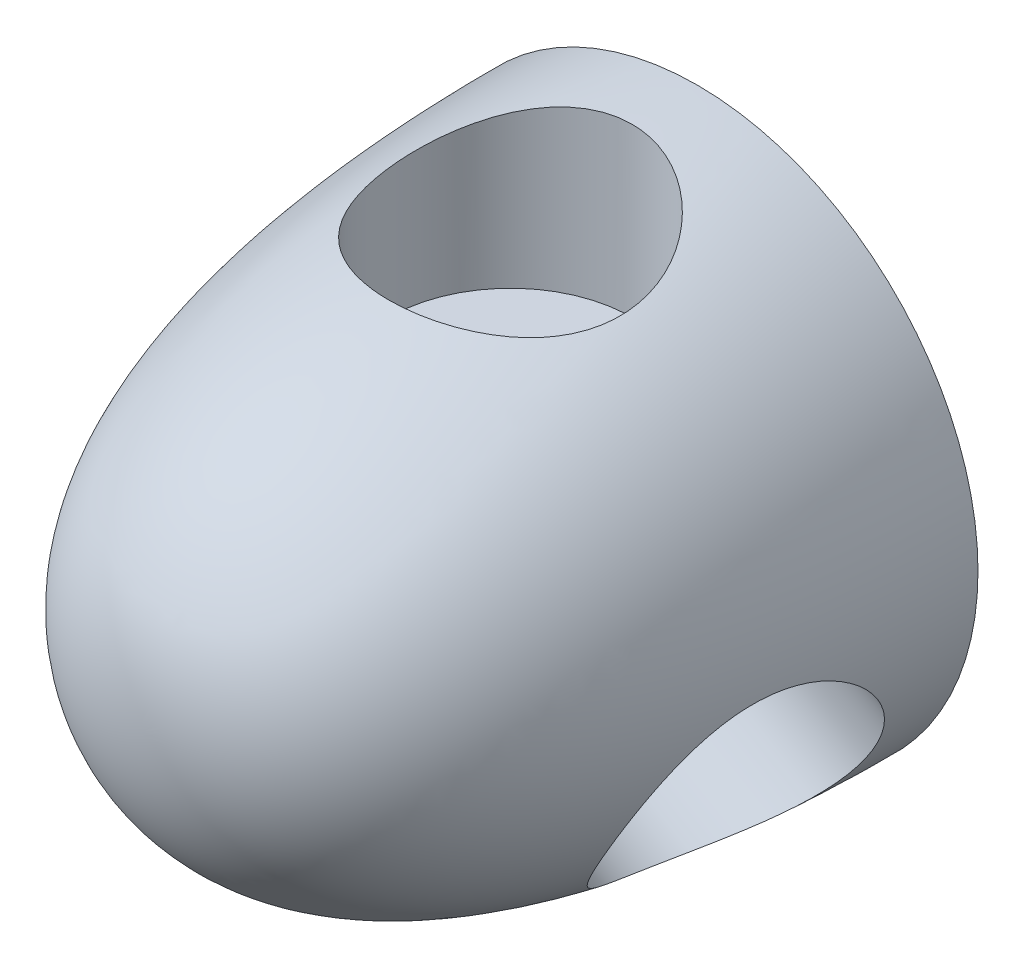
ISO-10303-21;
HEADER;
FILE_DESCRIPTION(('STEP AP214'),'2;1');
FILE_NAME('part.step','',(''),(''),'','','');
FILE_SCHEMA(('AUTOMOTIVE_DESIGN { 1 0 10303 214 1 1 1 1 }'));
ENDSEC;
DATA;
#1=APPLICATION_CONTEXT('core data for automotive mechanical design processes');
#2=APPLICATION_PROTOCOL_DEFINITION('international standard','automotive_design',2000,#1);
#3=PRODUCT_CONTEXT('',#1,'mechanical');
#4=PRODUCT('Part','Part','',(#3));
#5=PRODUCT_RELATED_PRODUCT_CATEGORY('part','',(#4));
#6=PRODUCT_DEFINITION_FORMATION('','',#4);
#7=PRODUCT_DEFINITION_CONTEXT('part definition',#1,'design');
#8=PRODUCT_DEFINITION('design','',#6,#7);
#9=PRODUCT_DEFINITION_SHAPE('','',#8);
#10=(LENGTH_UNIT() NAMED_UNIT(*) SI_UNIT(.MILLI.,.METRE.));
#11=(NAMED_UNIT(*) PLANE_ANGLE_UNIT() SI_UNIT($,.RADIAN.));
#12=(NAMED_UNIT(*) SI_UNIT($,.STERADIAN.) SOLID_ANGLE_UNIT());
#13=UNCERTAINTY_MEASURE_WITH_UNIT(LENGTH_MEASURE(1.E-05),#10,'distance_accuracy_value','');
#14=(GEOMETRIC_REPRESENTATION_CONTEXT(3) GLOBAL_UNCERTAINTY_ASSIGNED_CONTEXT((#13)) GLOBAL_UNIT_ASSIGNED_CONTEXT((#10,
#11,#12)) REPRESENTATION_CONTEXT('',''));
#15=CARTESIAN_POINT('',(0.,0.,0.));
#16=DIRECTION('',(0.,0.,1.));
#17=DIRECTION('',(1.,0.,0.));
#18=AXIS2_PLACEMENT_3D('',#15,#16,#17);
#19=CARTESIAN_POINT('',(0.,19.05,-38.1));
#20=CARTESIAN_POINT('',(0.,19.05,-23.9009683428763));
#21=CARTESIAN_POINT('',(0.,16.9337441759972,0.));
#22=CARTESIAN_POINT('',(0.,0.,0.));
#23=B_SPLINE_CURVE_WITH_KNOTS('',3,(#19,#20,#21,#22),.UNSPECIFIED.,.F.,.F.,(4,4),(0.,1.),.UNSPECIFIED.);
#24=CARTESIAN_POINT('',(0.,0.,0.));
#25=DIRECTION('',(0.,0.,1.));
#26=AXIS1_PLACEMENT('',#24,#25);
#27=SURFACE_OF_REVOLUTION('',#23,#26);
#28=CARTESIAN_POINT('',(0.,0.,0.));
#29=VERTEX_POINT('',#28);
#30=VERTEX_LOOP('',#29);
#31=FACE_BOUND('',#30,.T.);
#32=CARTESIAN_POINT('',(0.,0.,-38.1));
#33=DIRECTION('',(0.,0.,1.));
#34=DIRECTION('',(1.,0.,0.));
#35=AXIS2_PLACEMENT_3D('',#32,#33,#34);
#36=CIRCLE('',#35,19.05);
#37=CARTESIAN_POINT('',(19.05,0.,-38.1));
#38=VERTEX_POINT('',#37);
#39=EDGE_CURVE('E11',#38,#38,#36,.T.);
#40=ORIENTED_EDGE('',*,*,#39,.T.);
#41=EDGE_LOOP('',(#40));
#42=FACE_BOUND('',#41,.T.);
#43=CARTESIAN_POINT('',(0.,18.9763018383334,-33.655));
#44=CARTESIAN_POINT('',(-0.218211078954213,18.9763022513523,-33.6550005686562));
#45=CARTESIAN_POINT('',(-0.436414421110941,18.9722345507482,-33.6463396951044));
#46=CARTESIAN_POINT('',(-0.871144042653204,18.9560573129827,-33.6118008701064));
#47=CARTESIAN_POINT('',(-1.08767040292133,18.9439481661432,-33.5859237543153));
#48=CARTESIAN_POINT('',(-1.51743998162799,18.9119582977859,-33.5172507796383));
#49=CARTESIAN_POINT('',(-1.73068310557535,18.8920773530295,-33.474454434761));
#50=CARTESIAN_POINT('',(-2.15236542127592,18.8449772614248,-33.372415482399));
#51=CARTESIAN_POINT('',(-2.36080452305338,18.8177579772558,-33.3131725671529));
#52=CARTESIAN_POINT('',(-2.7708903116773,18.7566429551785,-33.1790487065769));
#53=CARTESIAN_POINT('',(-2.97255493238313,18.7227667942276,-33.1042135777946));
#54=CARTESIAN_POINT('',(-3.3685649330167,18.6489552318792,-32.9394834431129));
#55=CARTESIAN_POINT('',(-3.56290753940635,18.6090175626559,-32.849582799352));
#56=CARTESIAN_POINT('',(-3.94308256356839,18.5238613882089,-32.6555255845017));
#57=CARTESIAN_POINT('',(-4.12891673854075,18.4786439802919,-32.5513719748853));
#58=CARTESIAN_POINT('',(-4.49120576491487,18.3837451781798,-32.3295934773028));
#59=CARTESIAN_POINT('',(-4.66765691282271,18.3340620418671,-32.21196332707));
#60=CARTESIAN_POINT('',(-5.1989575309101,18.1743938736086,-31.8275222312541));
#61=CARTESIAN_POINT('',(-5.53653946005926,18.0581933062236,-31.5389447915065));
#62=CARTESIAN_POINT('',(-6.16002799663892,17.8182337172331,-30.9131112452231));
#63=CARTESIAN_POINT('',(-6.44591148077656,17.6944713463876,-30.5758334770679));
#64=CARTESIAN_POINT('',(-6.84188005031169,17.5048624089158,-30.024967637072));
#65=CARTESIAN_POINT('',(-6.97232701290918,17.4385706693425,-29.8258768940759));
#66=CARTESIAN_POINT('',(-7.21574423415549,17.3076613694495,-29.4167965166386));
#67=CARTESIAN_POINT('',(-7.32872054004017,17.2430432363096,-29.2068106871496));
#68=CARTESIAN_POINT('',(-7.5364327117597,17.1167773433105,-28.7770127256739));
#69=CARTESIAN_POINT('',(-7.63115937505361,17.0551310937352,-28.5571957047011));
#70=CARTESIAN_POINT('',(-7.80144100117607,16.9361654206379,-28.1092295823325));
#71=CARTESIAN_POINT('',(-7.87700461082378,16.8788440538589,-27.8810842921986));
#72=CARTESIAN_POINT('',(-8.00789634162892,16.7699796676346,-27.4189182659425));
#73=CARTESIAN_POINT('',(-8.06331745887121,16.7184108746828,-27.184930002927));
#74=CARTESIAN_POINT('',(-8.15368195587697,16.6218330055621,-26.7116858889895));
#75=CARTESIAN_POINT('',(-8.18862522858259,16.5768239636885,-26.4724300105351));
#76=CARTESIAN_POINT('',(-8.23739996769746,16.4943015195881,-25.9906383213747));
#77=CARTESIAN_POINT('',(-8.25124438777342,16.4567835305268,-25.7481046154564));
#78=CARTESIAN_POINT('',(-8.25742313991828,16.3898765340559,-25.2616487222552));
#79=CARTESIAN_POINT('',(-8.2497593006894,16.360486835786,-25.0177266547752));
#80=CARTESIAN_POINT('',(-8.21419554900191,16.3121849419798,-24.5499333079105));
#81=CARTESIAN_POINT('',(-8.1879438602203,16.2926279706806,-24.3260018388071));
#82=CARTESIAN_POINT('',(-8.11708934597051,16.2607395680525,-23.8805463791341));
#83=CARTESIAN_POINT('',(-8.07248752975279,16.2484077394339,-23.6590222568489));
#84=CARTESIAN_POINT('',(-7.96519068206703,16.2307519281812,-23.2201388566519));
#85=CARTESIAN_POINT('',(-7.90249711257765,16.2254273794884,-23.0027792437227));
#86=CARTESIAN_POINT('',(-7.75945953938698,16.2213314487669,-22.5738871624903));
#87=CARTESIAN_POINT('',(-7.67911557113857,16.2225600535756,-22.3623546824836));
#88=CARTESIAN_POINT('',(-7.50457508652718,16.2307647735812,-21.9541506548145));
#89=CARTESIAN_POINT('',(-7.41097763621884,16.2375335018484,-21.7572181967883));
#90=CARTESIAN_POINT('',(-7.2085708011828,16.2558279815828,-21.3714779053902));
#91=CARTESIAN_POINT('',(-7.09975599507692,16.267355431275,-21.1826729990526));
#92=CARTESIAN_POINT('',(-6.86772081906002,16.2943371027011,-20.8145040759658));
#93=CARTESIAN_POINT('',(-6.74450417171298,16.3097903109181,-20.6351376368841));
#94=CARTESIAN_POINT('',(-6.48439893158072,16.3437457334768,-20.2867946018461));
#95=CARTESIAN_POINT('',(-6.34750410444134,16.3622493406748,-20.1178228008558));
#96=CARTESIAN_POINT('',(-6.0552020567276,16.4021716796698,-19.7847896422554));
#97=CARTESIAN_POINT('',(-5.89927264206554,16.4236775492973,-19.6211968413961));
#98=CARTESIAN_POINT('',(-5.57469612528407,16.4679575197658,-19.3074872782167));
#99=CARTESIAN_POINT('',(-5.40605414672928,16.4907311087182,-19.1573651396636));
#100=CARTESIAN_POINT('',(-5.05697074579832,16.5365717949922,-18.8713698442033));
#101=CARTESIAN_POINT('',(-4.87652284035332,16.55963904788,-18.7355046247445));
#102=CARTESIAN_POINT('',(-4.50511331622689,16.6051017750843,-18.4790250841266));
#103=CARTESIAN_POINT('',(-4.31415547360708,16.6274974862654,-18.3584053361852));
#104=CARTESIAN_POINT('',(-3.91645812717439,16.6714619631989,-18.1294615584017));
#105=CARTESIAN_POINT('',(-3.7094066978972,16.6929797023879,-18.0216689101614));
#106=CARTESIAN_POINT('',(-3.28671169170762,16.7335167325747,-17.8239194505039));
#107=CARTESIAN_POINT('',(-3.07106790985396,16.7525359639327,-17.7339630648161));
#108=CARTESIAN_POINT('',(-2.63271795327241,16.7873321839229,-17.5725890675039));
#109=CARTESIAN_POINT('',(-2.41001247748034,16.8031094922775,-17.5011696275603));
#110=CARTESIAN_POINT('',(-1.95912240708193,16.8308187150126,-17.3774372059911));
#111=CARTESIAN_POINT('',(-1.73093793619867,16.8427507161377,-17.3251237933572));
#112=CARTESIAN_POINT('',(-1.27429743598263,16.862167114619,-17.2406939611263));
#113=CARTESIAN_POINT('',(-1.04589910122417,16.8697168369112,-17.2082804558152));
#114=CARTESIAN_POINT('',(-0.587087582102006,16.8803732168368,-17.1626765260383));
#115=CARTESIAN_POINT('',(-0.356674413941249,16.8834799101674,-17.1494859471277));
#116=CARTESIAN_POINT('',(0.104440347798196,16.8851367227885,-17.1424409376878));
#117=CARTESIAN_POINT('',(0.335141910254485,16.8836872973746,-17.1485845750785));
#118=CARTESIAN_POINT('',(0.795147399904788,16.8762856898303,-17.1801511724314));
#119=CARTESIAN_POINT('',(1.02445134068594,16.8703335515439,-17.2055739446671));
#120=CARTESIAN_POINT('',(1.47566642527761,16.8542978216727,-17.2748203605647));
#121=CARTESIAN_POINT('',(1.69763536511263,16.844294502676,-17.3182868711237));
#122=CARTESIAN_POINT('',(2.13706508685163,16.8205177309705,-17.4232209068863));
#123=CARTESIAN_POINT('',(2.35452593461618,16.8067443333823,-17.4846881689108));
#124=CARTESIAN_POINT('',(2.78348371165803,16.7759166603932,-17.6251570557117));
#125=CARTESIAN_POINT('',(2.99498019563224,16.7588621407613,-17.7041599858263));
#126=CARTESIAN_POINT('',(3.41060085409941,16.7220882441522,-17.8791179159225));
#127=CARTESIAN_POINT('',(3.61472489898095,16.7023688203534,-17.9750732137614));
#128=CARTESIAN_POINT('',(4.01713681004682,16.6606963729058,-18.1847492884799));
#129=CARTESIAN_POINT('',(4.21529999495602,16.6387155152994,-18.2987038233564));
#130=CARTESIAN_POINT('',(4.60147289753047,16.59361052211,-18.5426208895755));
#131=CARTESIAN_POINT('',(4.78947906883911,16.5704859925392,-18.6725889607997));
#132=CARTESIAN_POINT('',(5.15406499324502,16.5240435684958,-18.9476526390837));
#133=CARTESIAN_POINT('',(5.33064431004404,16.5007256666783,-19.092748823211));
#134=CARTESIAN_POINT('',(5.67122668747627,16.4549068223632,-19.3971360451616));
#135=CARTESIAN_POINT('',(5.83522975621659,16.432405879339,-19.5564270738342));
#136=CARTESIAN_POINT('',(6.15289390050983,16.3888182793481,-19.8917002050576));
#137=CARTESIAN_POINT('',(6.30626402781222,16.3677714426269,-20.0679634074595));
#138=CARTESIAN_POINT('',(6.59761037834034,16.3287725442074,-20.4330014280904));
#139=CARTESIAN_POINT('',(6.73559229414101,16.3108193367313,-20.621771578142));
#140=CARTESIAN_POINT('',(6.99519281227403,16.2791161063752,-21.0105874842184));
#141=CARTESIAN_POINT('',(7.11681152305516,16.2653660556375,-21.210633165501));
#142=CARTESIAN_POINT('',(7.34272545937975,16.2431229530751,-21.6205595050431));
#143=CARTESIAN_POINT('',(7.44702129022268,16.2346297175373,-21.8304398193303));
#144=CARTESIAN_POINT('',(7.6350892314259,16.2239679681711,-22.253156704251));
#145=CARTESIAN_POINT('',(7.71930467263199,16.2216484058297,-22.4657921879797));
#146=CARTESIAN_POINT('',(7.86979620661556,16.2236063462348,-22.8972938181457));
#147=CARTESIAN_POINT('',(7.93607260169483,16.2278837378038,-23.1161598595195));
#148=CARTESIAN_POINT('',(8.05017966703607,16.2435366764108,-23.5583294563208));
#149=CARTESIAN_POINT('',(8.09801604553766,16.2549100239853,-23.7816316159722));
#150=CARTESIAN_POINT('',(8.17497883016268,16.2850160434492,-24.2309434477031));
#151=CARTESIAN_POINT('',(8.20410577791869,16.3037485022691,-24.4569530412103));
#152=CARTESIAN_POINT('',(8.24270071391807,16.3475851515702,-24.8998712277871));
#153=CARTESIAN_POINT('',(8.25297956278081,16.3723716608102,-25.1167412823473));
#154=CARTESIAN_POINT('',(8.25648073821801,16.4284546173351,-25.5497650105119));
#155=CARTESIAN_POINT('',(8.24970363768083,16.4597508459342,-25.7659187079337));
#156=CARTESIAN_POINT('',(8.21935372231391,16.5284485636729,-26.1960837338593));
#157=CARTESIAN_POINT('',(8.19577888788663,16.5658507865216,-26.4100948016162));
#158=CARTESIAN_POINT('',(8.13221908669889,16.64618370406,-26.8346101176461));
#159=CARTESIAN_POINT('',(8.09223359420444,16.6891145758361,-27.0451142533458));
#160=CARTESIAN_POINT('',(7.99522707089801,16.7808431982724,-27.4661838429961));
#161=CARTESIAN_POINT('',(7.9378352934215,16.8297531976166,-27.6766392988992));
#162=CARTESIAN_POINT('',(7.8069308486039,16.9317810949619,-28.0915031248124));
#163=CARTESIAN_POINT('',(7.73341237898861,16.9849005030748,-28.2959092882096));
#164=CARTESIAN_POINT('',(7.57087588740715,17.0944027509829,-28.6975437598927));
#165=CARTESIAN_POINT('',(7.48185836201559,17.1507854861857,-28.8947722978979));
#166=CARTESIAN_POINT('',(7.28890758005209,17.2658656374413,-29.2811733020734));
#167=CARTESIAN_POINT('',(7.18496896691824,17.3245638792324,-29.4703428433606));
#168=CARTESIAN_POINT('',(6.95396330630475,17.4479936576519,-29.8543851920403));
#169=CARTESIAN_POINT('',(6.82571370390461,17.5128334711299,-30.0485129878815));
#170=CARTESIAN_POINT('',(6.55334562244744,17.6427729116306,-30.4252076790716));
#171=CARTESIAN_POINT('',(6.40922663131863,17.7078725469718,-30.6077742010629));
#172=CARTESIAN_POINT('',(6.10582430961553,17.8371045845802,-30.9604011299155));
#173=CARTESIAN_POINT('',(5.9465327684553,17.901236441142,-31.1304546761753));
#174=CARTESIAN_POINT('',(5.61374252666626,18.0272158570368,-31.4568323360369));
#175=CARTESIAN_POINT('',(5.44024906870075,18.0890642471906,-31.6131614722565));
#176=CARTESIAN_POINT('',(5.07393298898801,18.2112529900304,-31.9160229132577));
#177=CARTESIAN_POINT('',(4.88066073077984,18.2714757204343,-32.0620598666366));
#178=CARTESIAN_POINT('',(4.48106421555742,18.3868246839636,-32.3371388613645));
#179=CARTESIAN_POINT('',(4.27474566350069,18.4419531191463,-32.4661882560845));
#180=CARTESIAN_POINT('',(3.85031993357052,18.5458517237852,-32.7061257206861));
#181=CARTESIAN_POINT('',(3.63221495872469,18.5946230756837,-32.8170171690028));
#182=CARTESIAN_POINT('',(3.18571616470969,18.6846193848879,-33.019468963029));
#183=CARTESIAN_POINT('',(2.95732327018309,18.7258450186968,-33.1110310418057));
#184=CARTESIAN_POINT('',(2.50776028463827,18.7971889429844,-33.2682256347529));
#185=CARTESIAN_POINT('',(2.28714570360968,18.8278697151789,-33.3351926113148));
#186=CARTESIAN_POINT('',(1.84015036763376,18.8810226669957,-33.4505988029771));
#187=CARTESIAN_POINT('',(1.61376987587903,18.9034952205771,-33.4990388621522));
#188=CARTESIAN_POINT('',(1.1571590008445,18.9396710663129,-33.5767730429876));
#189=CARTESIAN_POINT('',(0.926930466844065,18.9533784531385,-33.6060761046842));
#190=CARTESIAN_POINT('',(0.464464975361829,18.9716934199942,-33.6451888534918));
#191=CARTESIAN_POINT('',(0.232228106338442,18.9763013987838,-33.6549993948155));
#192=CARTESIAN_POINT('',(0.,18.9763018383334,-33.655));
#193=B_SPLINE_CURVE_WITH_KNOTS('',3,(#43,#44,#45,#46,#47,#48,#49,#50,#51,#52,#53,#54,#55,#56,
#57,#58,#59,#60,#61,#62,#63,#64,#65,#66,#67,#68,#69,#70,#71,#72,#73,#74,#75,#76,#77,#78,#79,#80,
#81,#82,#83,#84,#85,#86,#87,#88,#89,#90,#91,#92,#93,#94,#95,#96,#97,#98,#99,#100,#101,#102,#103,
#104,#105,#106,#107,#108,#109,#110,#111,#112,#113,#114,#115,#116,#117,#118,#119,#120,#121,#122,
#123,#124,#125,#126,#127,#128,#129,#130,#131,#132,#133,#134,#135,#136,#137,#138,#139,#140,#141,
#142,#143,#144,#145,#146,#147,#148,#149,#150,#151,#152,#153,#154,#155,#156,#157,#158,#159,#160,
#161,#162,#163,#164,#165,#166,#167,#168,#169,#170,#171,#172,#173,#174,#175,#176,#177,#178,#179,
#180,#181,#182,#183,#184,#185,#186,#187,#188,#189,#190,#191,#192),.UNSPECIFIED.,.T.,.F.,(4,2,2,
2,2,2,2,2,2,2,2,2,2,2,2,2,2,2,2,2,2,2,2,2,2,2,2,2,2,2,2,2,2,2,2,2,2,2,2,2,2,2,2,2,2,2,2,2,2,2,2,
2,2,2,2,2,2,2,2,2,2,2,2,2,2,2,2,2,2,2,2,2,2,2,4),(0.,0.654411433519272,1.30879110503476,
1.96318957445094,2.61760029031836,3.27011452431898,3.92287349165931,4.5754970344735,
5.22837628533623,6.59942211016501,7.97107965748806,8.71157915998656,9.45182177191279,
10.1924366861694,10.9327168206153,11.6695343764557,12.4063557843322,13.1427246372924,
13.8790308836721,14.5571090686166,15.2351499644874,15.9131360838062,16.591120841323,
17.2448277693707,17.8987681850216,18.5525399434916,19.2066110546711,19.8869082783993,
20.5669327718912,21.2473338780789,21.9274921022916,22.6299027586448,23.3323301786492,
24.0346882911209,24.7370305582888,25.4286149867351,26.1201938586788,26.8117036229209,
27.5032066538153,28.1816304430464,28.860044313913,29.5385087021982,30.2169850124494,
30.9051334400104,31.5935206044447,32.2819340372734,32.9703470263216,33.6732742177604,
34.3759405060636,35.0786021371458,35.7812392105198,36.4665200148578,37.1517892703924,
37.8368462252293,38.5218833469727,39.1766884090502,39.831471477325,40.4863332836886,
41.141216070929,41.8111646792679,42.4813547270867,43.1515233066214,43.8219330762414,
44.5457179815263,45.2695262486739,45.9937284524931,46.7176645110476,47.4655556842198,
48.213122047118,48.960549160719,49.7079092316752,50.4047455253367,51.1015500677916,
51.7980288578613,52.4944771257528),.UNSPECIFIED.);
#194=CARTESIAN_POINT('',(0.,18.9763018383334,-33.655));
#195=VERTEX_POINT('',#194);
#196=EDGE_CURVE('E67',#195,#195,#193,.T.);
#197=ORIENTED_EDGE('',*,*,#196,.F.);
#198=EDGE_LOOP('',(#197));
#199=FACE_BOUND('',#198,.T.);
#200=CARTESIAN_POINT('',(10.0832512477112,-15.3536207664932,-25.4));
#201=CARTESIAN_POINT('',(10.1099187795631,-15.3690166379211,-25.6321503268283));
#202=CARTESIAN_POINT('',(10.1447153859241,-15.3777889197319,-25.8638146513919));
#203=CARTESIAN_POINT('',(10.2299321715435,-15.3821162544555,-26.3243780703952));
#204=CARTESIAN_POINT('',(10.2803536792256,-15.3776701832722,-26.5532769279959));
#205=CARTESIAN_POINT('',(10.3959364396404,-15.3556207638855,-27.006741410654));
#206=CARTESIAN_POINT('',(10.4611022032681,-15.3380133852726,-27.231305686711));
#207=CARTESIAN_POINT('',(10.6050971223443,-15.2897072092122,-27.6746561045278));
#208=CARTESIAN_POINT('',(10.6839319495038,-15.2590029697257,-27.8934398041523));
#209=CARTESIAN_POINT('',(10.8537068112358,-15.1847171173588,-28.323031348584));
#210=CARTESIAN_POINT('',(10.9445999367345,-15.141184645433,-28.5338662284792));
#211=CARTESIAN_POINT('',(11.1374401290916,-15.0412645059479,-28.9473099407718));
#212=CARTESIAN_POINT('',(11.2393913097808,-14.9848720455396,-29.1499156729589));
#213=CARTESIAN_POINT('',(11.559789055048,-14.7965086122072,-29.7436345231775));
#214=CARTESIAN_POINT('',(11.7929253408086,-14.6452896808938,-30.1210102104365));
#215=CARTESIAN_POINT('',(12.3013512824266,-14.281873841172,-30.8506750014841));
#216=CARTESIAN_POINT('',(12.5782706403194,-14.0667357606443,-31.2003748459631));
#217=CARTESIAN_POINT('',(13.0073746116088,-13.7022026518606,-31.6803485599995));
#218=CARTESIAN_POINT('',(13.1527915772695,-13.5736275141155,-31.8329915799435));
#219=CARTESIAN_POINT('',(13.4466094297292,-13.3027159205477,-32.1222965434601));
#220=CARTESIAN_POINT('',(13.5950089350072,-13.1603857248258,-32.2589656949527));
#221=CARTESIAN_POINT('',(13.892628811142,-12.8628160733293,-32.5147380058847));
#222=CARTESIAN_POINT('',(14.0418447711939,-12.7076214264388,-32.633898436264));
#223=CARTESIAN_POINT('',(14.3398224289114,-12.384544275225,-32.8539959101673));
#224=CARTESIAN_POINT('',(14.4885843103403,-12.2166679008212,-32.9549416790927));
#225=CARTESIAN_POINT('',(14.7839374743808,-11.8690328977038,-33.1375319320214));
#226=CARTESIAN_POINT('',(14.9305294894966,-11.6892783962054,-33.219183075545));
#227=CARTESIAN_POINT('',(15.2198574213801,-11.3189309138877,-33.3622220208654));
#228=CARTESIAN_POINT('',(15.3625937187039,-11.1283390085191,-33.4236118291979));
#229=CARTESIAN_POINT('',(15.6306972650354,-10.7542210750513,-33.5210150120119));
#230=CARTESIAN_POINT('',(15.7565129932714,-10.5714589751985,-33.5587344287761));
#231=CARTESIAN_POINT('',(16.0023006503375,-10.1992870052572,-33.6160621038612));
#232=CARTESIAN_POINT('',(16.1222729245838,-10.0098775292476,-33.6356714339332));
#233=CARTESIAN_POINT('',(16.3552484409986,-9.62591816276578,-33.6565336122083));
#234=CARTESIAN_POINT('',(16.468253922341,-9.43136995293768,-33.6577923893543));
#235=CARTESIAN_POINT('',(16.6864092036523,-9.03865420423977,-33.6419525728799));
#236=CARTESIAN_POINT('',(16.791559226391,-8.84048676820457,-33.6248545000453));
#237=CARTESIAN_POINT('',(16.9871162683976,-8.45434227535837,-33.5741138006867));
#238=CARTESIAN_POINT('',(17.0780312420119,-8.2664802177799,-33.5415429891985));
#239=CARTESIAN_POINT('',(17.2518444514362,-7.89042784531401,-33.4607538724615));
#240=CARTESIAN_POINT('',(17.3347431000968,-7.70223754784007,-33.4125363735935));
#241=CARTESIAN_POINT('',(17.4922554972084,-7.32688697798785,-33.3009363379469));
#242=CARTESIAN_POINT('',(17.5668688193631,-7.13972675907961,-33.2375530213859));
#243=CARTESIAN_POINT('',(17.7076921522352,-6.76776411816626,-33.0962167280354));
#244=CARTESIAN_POINT('',(17.7739018515177,-6.5829617837716,-33.0182632115445));
#245=CARTESIAN_POINT('',(17.8996733505444,-6.21186552834535,-32.8460879954138));
#246=CARTESIAN_POINT('',(17.958998144725,-6.02567383624917,-32.7514731037771));
#247=CARTESIAN_POINT('',(18.0689772108393,-5.65832780588639,-32.5483069093685));
#248=CARTESIAN_POINT('',(18.1196283522869,-5.47717530603421,-32.439750599507));
#249=CARTESIAN_POINT('',(18.2125099364597,-5.12116427434042,-32.2095261412228));
#250=CARTESIAN_POINT('',(18.2547408829545,-4.9463053664744,-32.0878587778892));
#251=CARTESIAN_POINT('',(18.3311585196226,-4.60396105607955,-31.8322052811503));
#252=CARTESIAN_POINT('',(18.3653423048715,-4.43647833394262,-31.6982147234256));
#253=CARTESIAN_POINT('',(18.4615839936839,-3.91898207362385,-31.2551947356179));
#254=CARTESIAN_POINT('',(18.5095316492699,-3.58438851615574,-30.92460031903));
#255=CARTESIAN_POINT('',(18.574384042092,-2.96503014970335,-30.2167405685369));
#256=CARTESIAN_POINT('',(18.5912734094434,-2.6802900748518,-29.8394522256178));
#257=CARTESIAN_POINT('',(18.5974080013618,-2.2905821371277,-29.2332507311638));
#258=CARTESIAN_POINT('',(18.5959185958427,-2.16404647181862,-29.018005363347));
#259=CARTESIAN_POINT('',(18.5864745996758,-1.92912289355371,-28.5780014041588));
#260=CARTESIAN_POINT('',(18.578522519764,-1.82072795268032,-28.3532465393462));
#261=CARTESIAN_POINT('',(18.5568724168896,-1.62347051534771,-27.8956000467151));
#262=CARTESIAN_POINT('',(18.5431746075953,-1.53460729274276,-27.6627087217654));
#263=CARTESIAN_POINT('',(18.5106900796087,-1.37772779704709,-27.1903444116156));
#264=CARTESIAN_POINT('',(18.4919036807105,-1.30971021447784,-26.9508718408655));
#265=CARTESIAN_POINT('',(18.4506131306615,-1.19786521845932,-26.4763140279347));
#266=CARTESIAN_POINT('',(18.4282773228557,-1.15321701335237,-26.2414077078411));
#267=CARTESIAN_POINT('',(18.3798359542008,-1.08514650339949,-25.7689125149221));
#268=CARTESIAN_POINT('',(18.3537304700742,-1.06172376663276,-25.531323696783));
#269=CARTESIAN_POINT('',(18.2980592238941,-1.03667996066134,-25.0555177827723));
#270=CARTESIAN_POINT('',(18.2684952005367,-1.03504798379309,-24.8173010609412));
#271=CARTESIAN_POINT('',(18.2060585245213,-1.05378774539644,-24.342174601975));
#272=CARTESIAN_POINT('',(18.1731860832985,-1.07415807854713,-24.1052647823374));
#273=CARTESIAN_POINT('',(18.1068392489322,-1.13430832558241,-23.6531674962335));
#274=CARTESIAN_POINT('',(18.0736109124826,-1.17245387587743,-23.4377246788188));
#275=CARTESIAN_POINT('',(18.0042617834214,-1.26691822123926,-23.0113467696371));
#276=CARTESIAN_POINT('',(17.9681411572251,-1.32323597128602,-22.8004114194047));
#277=CARTESIAN_POINT('',(17.8928177054027,-1.45339887197896,-22.384582310503));
#278=CARTESIAN_POINT('',(17.8536147435077,-1.5272447978302,-22.1796888194928));
#279=CARTESIAN_POINT('',(17.7718595196581,-1.69160463836882,-21.7773939715267));
#280=CARTESIAN_POINT('',(17.7293071908515,-1.78211888579642,-21.5799927642298));
#281=CARTESIAN_POINT('',(17.6408056410909,-1.9781729876916,-21.1952268148768));
#282=CARTESIAN_POINT('',(17.5948794103252,-2.08361499585056,-21.0078068684019));
#283=CARTESIAN_POINT('',(17.499022000946,-2.3088678088222,-20.6427968408087));
#284=CARTESIAN_POINT('',(17.4490893727393,-2.42868382226739,-20.4652103572671));
#285=CARTESIAN_POINT('',(17.3448623319204,-2.68145471970097,-20.1210161822118));
#286=CARTESIAN_POINT('',(17.290567971195,-2.81440944739657,-19.9544083601397));
#287=CARTESIAN_POINT('',(17.1772531347421,-3.09221324009286,-19.63314222288));
#288=CARTESIAN_POINT('',(17.1182324903588,-3.23706272955828,-19.4784843345084));
#289=CARTESIAN_POINT('',(16.9921801675233,-3.54457785313854,-19.1749069060532));
#290=CARTESIAN_POINT('',(16.9249000836818,-3.70776469420696,-19.0266179059371));
#291=CARTESIAN_POINT('',(16.784494110539,-4.04421700117713,-18.7451643169309));
#292=CARTESIAN_POINT('',(16.7113706397166,-4.21747828943152,-18.6119935255477));
#293=CARTESIAN_POINT('',(16.5589810352542,-4.57270425651598,-18.3615171619611));
#294=CARTESIAN_POINT('',(16.4797118775817,-4.75467320294243,-18.2442194791801));
#295=CARTESIAN_POINT('',(16.3149702009916,-5.12560785609486,-18.0264144501169));
#296=CARTESIAN_POINT('',(16.2295000637879,-5.31457086297784,-17.9259007058093));
#297=CARTESIAN_POINT('',(16.0508895791933,-5.70110858042162,-17.7408355734775));
#298=CARTESIAN_POINT('',(15.9576469893464,-5.89877341928969,-17.6565707882753));
#299=CARTESIAN_POINT('',(15.7648891952293,-6.29809616895328,-17.5067312123062));
#300=CARTESIAN_POINT('',(15.6653739021516,-6.49975413625489,-17.4411566862245));
#301=CARTESIAN_POINT('',(15.4604138237525,-6.90534734390595,-17.329243316726));
#302=CARTESIAN_POINT('',(15.3549698780374,-7.10928225853583,-17.282901757319));
#303=CARTESIAN_POINT('',(15.138643094341,-7.51777912497058,-17.2098361501715));
#304=CARTESIAN_POINT('',(15.027760388372,-7.72234106144317,-17.1831116265274));
#305=CARTESIAN_POINT('',(14.8038601627265,-8.12571714872109,-17.1499009771935));
#306=CARTESIAN_POINT('',(14.690951826907,-8.3245545577616,-17.1429597709841));
#307=CARTESIAN_POINT('',(14.461371062221,-8.71979479503036,-17.1480731503454));
#308=CARTESIAN_POINT('',(14.3446986895388,-8.91619765953764,-17.1601274525057));
#309=CARTESIAN_POINT('',(14.1085127942794,-9.30517441706407,-17.203129115579));
#310=CARTESIAN_POINT('',(13.988999405913,-9.49774849017099,-17.2340755857151));
#311=CARTESIAN_POINT('',(13.748163550624,-9.87779911056966,-17.314604675053));
#312=CARTESIAN_POINT('',(13.6268410819921,-10.0652756530442,-17.3641873118654));
#313=CARTESIAN_POINT('',(13.3846396676794,-10.4322900020026,-17.4810525242308));
#314=CARTESIAN_POINT('',(13.263766795387,-10.6118846863569,-17.5481692645954));
#315=CARTESIAN_POINT('',(13.0225539096388,-10.9639409047316,-17.6997970522471));
#316=CARTESIAN_POINT('',(12.9022138917219,-11.1364024985721,-17.7843079536259));
#317=CARTESIAN_POINT('',(12.6633243027846,-11.4733241345802,-17.9701070745249));
#318=CARTESIAN_POINT('',(12.5447746469821,-11.6377845564657,-18.0713944968616));
#319=CARTESIAN_POINT('',(12.3107188466582,-11.9580375796358,-18.290091072732));
#320=CARTESIAN_POINT('',(12.195213885286,-12.1138268367561,-18.4075063865135));
#321=CARTESIAN_POINT('',(11.966149952798,-12.4193666344465,-18.6604031411675));
#322=CARTESIAN_POINT('',(11.8526892928153,-12.5689096645217,-18.7962244632757));
#323=CARTESIAN_POINT('',(11.6318147225634,-12.8577305928543,-19.0830323834571));
#324=CARTESIAN_POINT('',(11.5244036375171,-12.9970037041754,-19.234025977006));
#325=CARTESIAN_POINT('',(11.3171538730672,-13.2647624426065,-19.550178991383));
#326=CARTESIAN_POINT('',(11.2173165651151,-13.393246116425,-19.7153409663236));
#327=CARTESIAN_POINT('',(11.0267739022393,-13.6389352517384,-20.0586620967211));
#328=CARTESIAN_POINT('',(10.9360642738861,-13.756145989889,-20.2368151019757));
#329=CARTESIAN_POINT('',(10.7642868390968,-13.9801862163427,-20.6069743211359));
#330=CARTESIAN_POINT('',(10.6833313220952,-14.0868926115372,-20.7991072693929));
#331=CARTESIAN_POINT('',(10.5336811615987,-14.2881289423318,-21.1941145086183));
#332=CARTESIAN_POINT('',(10.4649813806888,-14.3826639753322,-21.3969842524269));
#333=CARTESIAN_POINT('',(10.3411632359377,-14.5592919099611,-21.8119982848022));
#334=CARTESIAN_POINT('',(10.2860407204739,-14.6413886119892,-22.0241397148755));
#335=CARTESIAN_POINT('',(10.1905220705967,-14.7929131968285,-22.4561169260457));
#336=CARTESIAN_POINT('',(10.1501246907035,-14.8623421508537,-22.6759520546704));
#337=CARTESIAN_POINT('',(10.087948521706,-14.982568201951,-23.1011997296344));
#338=CARTESIAN_POINT('',(10.0648070430333,-15.0344874121146,-23.3060976040779));
#339=CARTESIAN_POINT('',(10.0319156044084,-15.1275640146563,-23.7193716256148));
#340=CARTESIAN_POINT('',(10.0221645404107,-15.1687222940514,-23.9277474845129));
#341=CARTESIAN_POINT('',(10.0162935694862,-15.2401914052491,-24.3465347305552));
#342=CARTESIAN_POINT('',(10.0201733000805,-15.270502525483,-24.5569460634225));
#343=CARTESIAN_POINT('',(10.0415547673333,-15.3202338343148,-24.9783715704582));
#344=CARTESIAN_POINT('',(10.0590576091625,-15.3396531390976,-25.189385792152));
#345=CARTESIAN_POINT('',(10.0832512477112,-15.3536207664932,-25.4));
#346=B_SPLINE_CURVE_WITH_KNOTS('',3,(#200,#201,#202,#203,#204,#205,#206,#207,#208,#209,#210,
#211,#212,#213,#214,#215,#216,#217,#218,#219,#220,#221,#222,#223,#224,#225,#226,#227,#228,#229,
#230,#231,#232,#233,#234,#235,#236,#237,#238,#239,#240,#241,#242,#243,#244,#245,#246,#247,#248,
#249,#250,#251,#252,#253,#254,#255,#256,#257,#258,#259,#260,#261,#262,#263,#264,#265,#266,#267,
#268,#269,#270,#271,#272,#273,#274,#275,#276,#277,#278,#279,#280,#281,#282,#283,#284,#285,#286,
#287,#288,#289,#290,#291,#292,#293,#294,#295,#296,#297,#298,#299,#300,#301,#302,#303,#304,#305,
#306,#307,#308,#309,#310,#311,#312,#313,#314,#315,#316,#317,#318,#319,#320,#321,#322,#323,#324,
#325,#326,#327,#328,#329,#330,#331,#332,#333,#334,#335,#336,#337,#338,#339,#340,#341,#342,#343,
#344,#345),.UNSPECIFIED.,.T.,.F.,(4,2,2,2,2,2,2,2,2,2,2,2,2,2,2,2,2,2,2,2,2,2,2,2,2,2,2,2,2,2,2,
2,2,2,2,2,2,2,2,2,2,2,2,2,2,2,2,2,2,2,2,2,2,2,2,2,2,2,2,2,2,2,2,2,2,2,2,2,2,2,2,2,4),(0.,
0.702339120622022,1.40473797026374,2.10735200486446,2.81025827617058,3.51050618010435,
4.21101549045036,5.61086560693614,7.0891272908584,7.82918021875547,8.56889791126588,
9.30613938713548,10.0430267578774,10.7796594199906,11.5162191094459,12.1905359600729,
12.8648129022142,13.5388719850851,14.2129119453374,14.845872541714,15.4788005224774,
16.1117610535613,16.7447450350757,17.3953887111609,18.0462667242279,18.6971057843924,
19.3481794302539,20.7601187408642,22.1727565932036,22.9210362541201,23.6690253487586,
24.4169866301249,25.1649009165281,25.8844030072394,26.6038904563473,27.3230177426412,
28.0420990999006,28.7052040868324,29.3682709476951,30.0313671389682,30.6944765686889,
31.3534251274967,32.0126131913854,32.6717934147854,33.3309971712702,34.0218032214971,
34.7123248250816,35.4031883883205,36.0937879906624,36.7956339889221,37.4974899259959,
38.1992467164912,38.9009864820107,39.5864483266729,40.2718999444319,40.9573192452344,
41.6427391937341,42.3218975117989,43.0010501330818,43.6801704917746,44.3595509739887,
45.053838635186,45.7484478932397,46.4431826316451,47.137590578343,47.839352883392,
48.540820325749,49.2420730080971,49.9432663633927,50.5804686876965,51.2176184712341,
51.8547513113994,52.4919358441607),.UNSPECIFIED.);
#347=CARTESIAN_POINT('',(10.0832512477112,-15.3536207664932,-25.4));
#348=VERTEX_POINT('',#347);
#349=EDGE_CURVE('E71',#348,#348,#346,.T.);
#350=ORIENTED_EDGE('',*,*,#349,.F.);
#351=EDGE_LOOP('',(#350));
#352=FACE_BOUND('',#351,.T.);
#353=CARTESIAN_POINT('',(-18.338251247711,-1.05554135001232,-25.4));
#354=CARTESIAN_POINT('',(-18.3649182294069,-1.07093817433836,-25.6321503268283));
#355=CARTESIAN_POINT('',(-18.3899135514847,-1.09668677850711,-25.8638146513919));
#356=CARTESIAN_POINT('',(-18.4362695260958,-1.16832301232056,-26.3243780703952));
#357=CARTESIAN_POINT('',(-18.457629869345,-1.21421235446199,-26.5532769279959));
#358=CARTESIAN_POINT('',(-18.4963258922248,-1.32533467091409,-27.006741410654));
#359=CARTESIAN_POINT('',(-18.5136603368659,-1.39057356697919,-27.231305686711));
#360=CARTESIAN_POINT('',(-18.543823420776,-1.53942991294525,-27.6746561045278));
#361=CARTESIAN_POINT('',(-18.5566501829566,-1.6230549957115,-27.8934398041523));
#362=CARTESIAN_POINT('',(-18.577204178531,-1.80722726507892,-28.323031348584));
#363=CARTESIAN_POINT('',(-18.5849505147031,-1.90770925675304,-28.5338662284792));
#364=CARTESIAN_POINT('',(-18.5948372317379,-2.12467383194752,-28.9473099407718));
#365=CARTESIAN_POINT('',(-18.596975518787,-2.24116237457436,-29.1499156729589));
#366=CARTESIAN_POINT('',(-18.5940468730107,-2.61281667795715,-29.7436345231775));
#367=CARTESIAN_POINT('',(-18.5796555798405,-2.89032808962652,-30.1210102104365));
#368=CARTESIAN_POINT('',(-18.5191412013127,-3.51234579087164,-30.8506750014841));
#369=CARTESIAN_POINT('',(-18.4712858372006,-3.85973402987032,-31.2003748459631));
#370=CARTESIAN_POINT('',(-18.3701428901183,-4.4136155242636,-31.6803485599995));
#371=CARTESIAN_POINT('',(-18.3315020373663,-4.60383787953957,-31.8329915799435));
#372=CARTESIAN_POINT('',(-18.2437946413867,-4.99374740063894,-32.1222965434601));
#373=CARTESIAN_POINT('',(-18.1947328288049,-5.19343023997968,-32.2589656949527));
#374=CARTESIAN_POINT('',(-18.085839889281,-5.59996143913179,-32.5147380058847));
#375=CARTESIAN_POINT('',(-18.0260453625684,-5.80678357463208,-32.633898436264));
#376=CARTESIAN_POINT('',(-17.8952411710937,-6.22637837158259,-32.8539959101673));
#377=CARTESIAN_POINT('',(-17.8242369068793,-6.43914812721668,-32.9549416790927));
#378=CARTESIAN_POINT('',(-17.6708527449552,-6.86874897192257,-33.1375319320214));
#379=CARTESIAN_POINT('',(-17.5884767877708,-7.08557863175399,-33.219183075545));
#380=CARTESIAN_POINT('',(-17.4124104257978,-7.5213177119483,-33.3622220208654));
#381=CARTESIAN_POINT('',(-17.3187211426549,-7.74022692415713,-33.4236118291979));
#382=CARTESIAN_POINT('',(-17.1287772814261,-8.15947037285884,-33.5210150120119));
#383=CARTESIAN_POINT('',(-17.0334085242227,-8.35981103963324,-33.5587344287761));
#384=CARTESIAN_POINT('',(-16.83399197221,-8.7587553795598,-33.6160621038612));
#385=CARTESIAN_POINT('',(-16.7299446913914,-8.95735915481172,-33.6356714339332));
#386=CARTESIAN_POINT('',(-16.5139138842046,-9.35110155372764,-33.6565336122083));
#387=CARTESIAN_POINT('',(-16.4019329329038,-9.54624127625108,-33.6577923893543));
#388=CARTESIAN_POINT('',(-16.1709087587209,-9.93152716618541,-33.6419525728799));
#389=CARTESIAN_POINT('',(-16.0518657362809,-10.1216734751032,-33.6248545000453));
#390=CARTESIAN_POINT('',(-15.815233316948,-10.484103087793,-33.5741138006867));
#391=CARTESIAN_POINT('',(-15.6979974894849,-10.6567687933165,-33.5415429891985));
#392=CARTESIAN_POINT('',(-15.4592331864882,-10.9953216344243,-33.4607538724615));
#393=CARTESIAN_POINT('',(-15.3377049324603,-11.1612091188407,-33.4125363735935));
#394=CARTESIAN_POINT('',(-15.0913980021991,-11.4852941410765,-33.3009363379469));
#395=CARTESIAN_POINT('',(-14.9666191591241,-11.6434912829773,-33.2375530213859));
#396=CARTESIAN_POINT('',(-14.7149017292705,-11.9514291871469,-33.0962167280354));
#397=CARTESIAN_POINT('',(-14.5879630626472,-12.1011696358997,-33.0182632115445));
#398=CARTESIAN_POINT('',(-14.3294700277122,-12.395639076842,-32.8460879954138));
#399=CARTESIAN_POINT('',(-14.1978856894736,-12.5401117017248,-32.7514731037771));
#400=CARTESIAN_POINT('',(-13.9347442282572,-12.8190293820457,-32.5483069093685));
#401=CARTESIAN_POINT('',(-13.80318713215,-12.9534708071961,-32.4397505995071));
#402=CARTESIAN_POINT('',(-13.541313326762,-13.2119141344803,-32.2095261412228));
#403=CARTESIAN_POINT('',(-13.4109965437195,-13.3359166609037,-32.0878587778892));
#404=CARTESIAN_POINT('',(-13.1527264924105,-13.5732684307529,-31.8322052811503));
#405=CARTESIAN_POINT('',(-13.0247740929694,-13.6866138182444,-31.6982147234257));
#406=CARTESIAN_POINT('',(-12.6247300295761,-14.0287096958184,-31.2551947356179));
#407=CARTESIAN_POINT('',(-12.3589373366591,-14.2375303623419,-30.92460031903));
#408=CARTESIAN_POINT('',(-11.854983453676,-14.6033733652482,-30.2167405685369));
#409=CARTESIAN_POINT('',(-11.6168359990547,-14.7603700238542,-29.8394522256178));
#410=CARTESIAN_POINT('',(-11.2824063208884,-14.9605367051594,-29.2332507311638));
#411=CARTESIAN_POINT('',(-11.1720785174865,-15.0225146747979,-29.0180053633471));
#412=CARTESIAN_POINT('',(-10.9639067326776,-15.1317977233365,-28.5780014041588));
#413=CARTESIAN_POINT('',(-10.8660579202837,-15.1791084905567,-28.3532465393462));
#414=CARTESIAN_POINT('',(-10.684402917031,-15.2589876701392,-27.8956000467151));
#415=CARTESIAN_POINT('',(-10.6005962041458,-15.2915566306166,-27.6627087217654));
#416=CARTESIAN_POINT('',(-10.4484923115472,-15.3418639519982,-27.1903444116156));
#417=CARTESIAN_POINT('',(-10.3801941576891,-15.3596032445913,-26.9508718408655));
#418=CARTESIAN_POINT('',(-10.2626882748264,-15.3797670773219,-26.4763140279347));
#419=CARTESIAN_POINT('',(-10.2128538910675,-15.3827478029015,-26.2414077078411));
#420=CARTESIAN_POINT('',(-10.1296824158723,-15.3748316020287,-25.7689125149221));
#421=CARTESIAN_POINT('',(-10.0963449887429,-15.3639349579804,-25.531323696783));
#422=CARTESIAN_POINT('',(-10.0468207934741,-15.3282441475137,-25.0555177827723));
#423=CARTESIAN_POINT('',(-10.0306254483691,-15.3034569406823,-24.8173010609412));
#424=CARTESIAN_POINT('',(-10.0156362199708,-15.2400153123234,-24.3421746019749));
#425=CARTESIAN_POINT('',(-10.0168412253514,-15.2013617765647,-24.1052647823374));
#426=CARTESIAN_POINT('',(-10.0357594501447,-15.1138286090252,-23.6531674962335));
#427=CARTESIAN_POINT('',(-10.0521802975168,-15.0659792503868,-23.4377246788188));
#428=CARTESIAN_POINT('',(-10.0993142558214,-14.9586889702086,-23.0113467696371));
#429=CARTESIAN_POINT('',(-10.1300265449477,-14.8992487152986,-22.8004114194047));
#430=CARTESIAN_POINT('',(-10.2050891976668,-14.7689352421732,-22.384582310503));
#431=CARTESIAN_POINT('',(-10.2494401644725,-14.6980615183429,-22.1796888194928));
#432=CARTESIAN_POINT('',(-10.3509023498161,-14.5450794973277,-21.7773939715267));
#433=CARTESIAN_POINT('',(-10.4080138230896,-14.4629709758773,-21.5799927642298));
#434=CARTESIAN_POINT('',(-10.5335508809666,-14.2882993345627,-21.1952268148768));
#435=CARTESIAN_POINT('',(-10.6019032232755,-14.1958050479401,-21.0078068684019));
#436=CARTESIAN_POINT('',(-10.7490491768932,-14.0001636897909,-20.6427968408087));
#437=CARTESIAN_POINT('',(-10.8278465742136,-13.8970127585635,-20.4652103572671));
#438=CARTESIAN_POINT('',(-10.994639072319,-13.6803640447363,-20.1210161822118));
#439=CARTESIAN_POINT('',(-11.0826340636939,-13.5668663852181,-19.9544083601397));
#440=CARTESIAN_POINT('',(-11.2665617872101,-13.329830961876,-19.63314222288));
#441=CARTESIAN_POINT('',(-11.3624948026207,-13.2062928397597,-19.4784843345084));
#442=CARTESIAN_POINT('',(-11.5657845502714,-12.943370764188,-19.1749069060532));
#443=CARTESIAN_POINT('',(-11.6734684582792,-12.8035110818783,-19.0266179059371));
#444=CARTESIAN_POINT('',(-11.8946417167059,-12.5136897888084,-18.7451643169309));
#445=CARTESIAN_POINT('',(-12.0081286584154,-12.3637323613362,-18.6119935255477));
#446=CARTESIAN_POINT('',(-12.2395685677632,-12.0541461090569,-18.3615171619611));
#447=CARTESIAN_POINT('',(-12.3575237192322,-11.8945125315627,-18.2442194791802));
#448=CARTESIAN_POINT('',(-12.5963917137111,-11.5663747279974,-18.0264144501169));
#449=CARTESIAN_POINT('',(-12.7173034094454,-11.3978739144725,-17.9259007058093));
#450=CARTESIAN_POINT('',(-12.9627496499753,-11.0499238387095,-17.7408355734775));
#451=CARTESIAN_POINT('',(-13.0873111269465,-10.8703409677533,-17.6565707882753));
#452=CARTESIAN_POINT('',(-13.3367558754057,-10.5037464464387,-17.5067312123062));
#453=CARTESIAN_POINT('',(-13.4616391514255,-10.3167346909175,-17.4411566862245));
#454=CARTESIAN_POINT('',(-13.7104131336542,-9.93643745243674,-17.329243316726));
#455=CARTESIAN_POINT('',(-13.8343039775848,-9.74315285945728,-17.282901757319));
#456=CARTESIAN_POINT('',(-14.0799092494354,-9.35155993603982,-17.2098361501715));
#457=CARTESIAN_POINT('',(-14.2016237300835,-9.153251727594,-17.1831116265274));
#458=CARTESIAN_POINT('',(-14.4390075561226,-8.75766040063295,-17.1499009771935));
#459=CARTESIAN_POINT('',(-14.5547516356646,-8.56046020899404,-17.1429597709841));
#460=CARTESIAN_POINT('',(-14.7822493393942,-8.16401731592131,-17.1480731503454));
#461=CARTESIAN_POINT('',(-14.8940030230924,-7.96477464500509,-17.1601274525057));
#462=CARTESIAN_POINT('',(-15.1127738289622,-7.5657432809316,-17.203129115579));
#463=CARTESIAN_POINT('',(-15.2197911741999,-7.36595461396049,-17.2340755857151));
#464=CARTESIAN_POINT('',(-15.4285067385447,-6.96735933493879,-17.314604675053));
#465=CARTESIAN_POINT('',(-15.5302049526254,-6.76855272381637,-17.3641873118655));
#466=CARTESIAN_POINT('',(-15.7269479952204,-6.3752929717099,-17.4810525242308));
#467=CARTESIAN_POINT('',(-15.8220451181097,-6.18081665149909,-17.5481692645954));
#468=CARTESIAN_POINT('',(-16.0063283039083,-5.7958920555337,-17.699797052247));
#469=CARTESIAN_POINT('',(-16.0955144163929,-5.60544374600555,-17.7843079536259));
#470=CARTESIAN_POINT('',(-16.2678523177919,-5.2300984752822,-17.9701070745249));
#471=CARTESIAN_POINT('',(-16.3510043931606,-5.04520125080453,-18.0713944968616));
#472=CARTESIAN_POINT('',(-16.5113237467027,-4.68237647023593,-18.290091072732));
#473=CARTESIAN_POINT('',(-16.5884887203194,-4.50445161086426,-18.4075063865135));
#474=CARTESIAN_POINT('',(-16.7385619807426,-4.15330652739371,-18.6604031411675));
#475=CARTESIAN_POINT('',(-16.8113397137552,-3.98027519848096,-18.7962244632757));
#476=CARTESIAN_POINT('',(-16.9510286897099,-3.64458174542656,-19.0830323834571));
#477=CARTESIAN_POINT('',(-17.0179371996549,-3.4819244614678,-19.234025977006));
#478=CARTESIAN_POINT('',(-17.1461981869965,-3.1685615313103,-19.550178991383));
#479=CARTESIAN_POINT('',(-17.2075496585189,-3.01785804946913,-19.7153409663236));
#480=CARTESIAN_POINT('',(-17.3250513596962,-2.72999869525721,-20.058662096721));
#481=CARTESIAN_POINT('',(-17.3812040223543,-2.59283648366022,-20.2368151019757));
#482=CARTESIAN_POINT('',(-17.4893398325382,-2.3320527481089,-20.6069743211358));
#483=CARTESIAN_POINT('',(-17.5412725230221,-2.20859001621172,-20.7991072693929));
#484=CARTESIAN_POINT('',(-17.6407232174064,-1.97837101014408,-21.1941145086182));
#485=CARTESIAN_POINT('',(-17.6882430670773,-1.87160773814145,-21.3969842524268));
#486=CARTESIAN_POINT('',(-17.7792982731085,-1.67606411202313,-21.8119982848022));
#487=CARTESIAN_POINT('',(-17.8228348448997,-1.58727826229691,-22.0241397148755));
#488=CARTESIAN_POINT('',(-17.9062996597299,-1.42879439254841,-22.4561169260457));
#489=CARTESIAN_POINT('',(-17.9462282077273,-1.35909475830195,-22.6759520546704));
#490=CARTESIAN_POINT('',(-18.0192589376756,-1.2451355908915,-23.1011997296344));
#491=CARTESIAN_POINT('',(-18.0526515532853,-1.19913487739799,-23.3060976040779));
#492=CARTESIAN_POINT('',(-18.1168125362719,-1.12411175471093,-23.7193716256148));
#493=CARTESIAN_POINT('',(-18.1475811198052,-1.09508794587745,-23.9277474845129));
#494=CARTESIAN_POINT('',(-18.2065397002261,-1.0542689803131,-24.3465347305552));
#495=CARTESIAN_POINT('',(-18.2347297656629,-1.04247336545073,-24.5569460634225));
#496=CARTESIAN_POINT('',(-18.2884890761011,-1.03612460484591,-24.9783715704582));
#497=CARTESIAN_POINT('',(-18.3140581082815,-1.04157285811698,-25.189385792152));
#498=CARTESIAN_POINT('',(-18.338251247711,-1.05554135001232,-25.4));
#499=B_SPLINE_CURVE_WITH_KNOTS('',3,(#353,#354,#355,#356,#357,#358,#359,#360,#361,#362,#363,
#364,#365,#366,#367,#368,#369,#370,#371,#372,#373,#374,#375,#376,#377,#378,#379,#380,#381,#382,
#383,#384,#385,#386,#387,#388,#389,#390,#391,#392,#393,#394,#395,#396,#397,#398,#399,#400,#401,
#402,#403,#404,#405,#406,#407,#408,#409,#410,#411,#412,#413,#414,#415,#416,#417,#418,#419,#420,
#421,#422,#423,#424,#425,#426,#427,#428,#429,#430,#431,#432,#433,#434,#435,#436,#437,#438,#439,
#440,#441,#442,#443,#444,#445,#446,#447,#448,#449,#450,#451,#452,#453,#454,#455,#456,#457,#458,
#459,#460,#461,#462,#463,#464,#465,#466,#467,#468,#469,#470,#471,#472,#473,#474,#475,#476,#477,
#478,#479,#480,#481,#482,#483,#484,#485,#486,#487,#488,#489,#490,#491,#492,#493,#494,#495,#496,
#497,#498),.UNSPECIFIED.,.T.,.F.,(4,2,2,2,2,2,2,2,2,2,2,2,2,2,2,2,2,2,2,2,2,2,2,2,2,2,2,2,2,2,2,
2,2,2,2,2,2,2,2,2,2,2,2,2,2,2,2,2,2,2,2,2,2,2,2,2,2,2,2,2,2,2,2,2,2,2,2,2,2,2,2,2,4),(0.,
0.702339120622017,1.40473797026374,2.10735200486446,2.81025827617058,3.51050618010434,
4.21101549045036,5.61086560693614,7.0891272908584,7.82918021875547,8.56889791126588,
9.30613938713548,10.0430267578774,10.7796594199906,11.5162191094459,12.1905359600728,
12.8648129022142,13.5388719850851,14.2129119453374,14.845872541714,15.4788005224774,
16.1117610535613,16.7447450350757,17.3953887111609,18.0462667242279,18.6971057843924,
19.3481794302539,20.7601187408642,22.1727565932036,22.9210362541201,23.6690253487586,
24.4169866301249,25.1649009165281,25.8844030072394,26.6038904563473,27.3230177426413,
28.0420990999006,28.7052040868324,29.3682709476951,30.0313671389682,30.6944765686889,
31.3534251274967,32.0126131913854,32.6717934147854,33.3309971712702,34.0218032214971,
34.7123248250816,35.4031883883205,36.0937879906624,36.7956339889221,37.4974899259959,
38.1992467164912,38.9009864820107,39.5864483266729,40.2718999444319,40.9573192452344,
41.6427391937341,42.3218975117989,43.0010501330818,43.6801704917746,44.3595509739887,
45.053838635186,45.7484478932397,46.4431826316451,47.137590578343,47.839352883392,
48.540820325749,49.2420730080971,49.9432663633928,50.5804686876965,51.2176184712341,
51.8547513113994,52.4919358441607),.UNSPECIFIED.);
#500=CARTESIAN_POINT('',(-18.338251247711,-1.05554135001232,-25.4));
#501=VERTEX_POINT('',#500);
#502=EDGE_CURVE('E46',#501,#501,#499,.T.);
#503=ORIENTED_EDGE('',*,*,#502,.F.);
#504=EDGE_LOOP('',(#503));
#505=FACE_BOUND('',#504,.T.);
#506=ADVANCED_FACE('F41',(#31,#42,#199,#352,#505),#27,.T.);
#507=CARTESIAN_POINT('',(0.,0.,-38.1));
#508=DIRECTION('',(0.,0.,1.));
#509=DIRECTION('',(1.,0.,0.));
#510=AXIS2_PLACEMENT_3D('',#507,#508,#509);
#511=PLANE('',#510);
#512=CARTESIAN_POINT('',(0.,0.,-38.1));
#513=DIRECTION('',(0.,0.,-1.));
#514=DIRECTION('',(-1.,0.,0.));
#515=AXIS2_PLACEMENT_3D('',#512,#513,#514);
#516=CIRCLE('',#515,4.826);
#517=CARTESIAN_POINT('',(-4.826,0.,-38.1));
#518=VERTEX_POINT('',#517);
#519=EDGE_CURVE('E125',#518,#518,#516,.T.);
#520=ORIENTED_EDGE('',*,*,#519,.F.);
#521=EDGE_LOOP('',(#520));
#522=FACE_BOUND('',#521,.T.);
#523=ORIENTED_EDGE('',*,*,#39,.F.);
#524=EDGE_LOOP('',(#523));
#525=FACE_BOUND('',#524,.T.);
#526=ADVANCED_FACE('F61',(#522,#525),#511,.F.);
#527=CARTESIAN_POINT('',(0.,0.,-25.4));
#528=DIRECTION('',(0.,0.,-1.));
#529=DIRECTION('',(-1.,0.,0.));
#530=AXIS2_PLACEMENT_3D('',#527,#528,#529);
#531=CYLINDRICAL_SURFACE('',#530,4.826);
#532=CARTESIAN_POINT('',(0.,0.,-25.4));
#533=DIRECTION('',(0.,0.,-1.));
#534=DIRECTION('',(-1.,0.,0.));
#535=AXIS2_PLACEMENT_3D('',#532,#533,#534);
#536=CIRCLE('',#535,4.826);
#537=CARTESIAN_POINT('',(-4.826,0.,-25.4));
#538=VERTEX_POINT('',#537);
#539=EDGE_CURVE('E55',#538,#538,#536,.T.);
#540=ORIENTED_EDGE('',*,*,#539,.F.);
#541=EDGE_LOOP('',(#540));
#542=FACE_BOUND('',#541,.T.);
#543=ORIENTED_EDGE('',*,*,#519,.T.);
#544=EDGE_LOOP('',(#543));
#545=FACE_BOUND('',#544,.T.);
#546=ADVANCED_FACE('F114',(#542,#545),#531,.F.);
#547=CARTESIAN_POINT('',(0.,0.,-25.4));
#548=DIRECTION('',(0.,0.,-1.));
#549=DIRECTION('',(-1.,0.,0.));
#550=AXIS2_PLACEMENT_3D('',#547,#548,#549);
#551=PLANE('',#550);
#552=ORIENTED_EDGE('',*,*,#539,.T.);
#553=EDGE_LOOP('',(#552));
#554=FACE_BOUND('',#553,.T.);
#555=ADVANCED_FACE('F110',(#554),#551,.T.);
#556=CARTESIAN_POINT('',(0.,23.876,-25.4));
#557=DIRECTION('',(0.,-1.,0.));
#558=DIRECTION('',(0.,0.,-1.));
#559=AXIS2_PLACEMENT_3D('',#556,#557,#558);
#560=CYLINDRICAL_SURFACE('',#559,8.255);
#561=CARTESIAN_POINT('',(0.,7.62,-25.4));
#562=DIRECTION('',(0.,1.,0.));
#563=DIRECTION('',(0.,0.,1.));
#564=AXIS2_PLACEMENT_3D('',#561,#562,#563);
#565=CIRCLE('',#564,8.255);
#566=CARTESIAN_POINT('',(0.,7.62,-17.145));
#567=VERTEX_POINT('',#566);
#568=EDGE_CURVE('E76',#567,#567,#565,.T.);
#569=ORIENTED_EDGE('',*,*,#568,.F.);
#570=EDGE_LOOP('',(#569));
#571=FACE_BOUND('',#570,.T.);
#572=ORIENTED_EDGE('',*,*,#196,.T.);
#573=EDGE_LOOP('',(#572));
#574=FACE_BOUND('',#573,.T.);
#575=ADVANCED_FACE('F105',(#571,#574),#560,.F.);
#576=CARTESIAN_POINT('',(0.,7.62,-25.4));
#577=DIRECTION('',(0.,1.,0.));
#578=DIRECTION('',(0.,0.,1.));
#579=AXIS2_PLACEMENT_3D('',#576,#577,#578);
#580=PLANE('',#579);
#581=ORIENTED_EDGE('',*,*,#568,.T.);
#582=EDGE_LOOP('',(#581));
#583=FACE_BOUND('',#582,.T.);
#584=ADVANCED_FACE('F102',(#583),#580,.T.);
#585=CARTESIAN_POINT('',(20.6772225407574,-11.9379999999998,-25.4));
#586=DIRECTION('',(-0.866025403784443,0.499999999999992,0.));
#587=DIRECTION('',(-0.499999999999992,-0.866025403784443,0.));
#588=AXIS2_PLACEMENT_3D('',#585,#586,#587);
#589=CYLINDRICAL_SURFACE('',#588,8.255);
#590=CARTESIAN_POINT('',(6.59911357683746,-3.80999999999994,-25.4));
#591=DIRECTION('',(0.866025403784443,-0.499999999999992,0.));
#592=DIRECTION('',(0.,0.,1.));
#593=AXIS2_PLACEMENT_3D('',#590,#591,#592);
#594=CIRCLE('',#593,8.255);
#595=CARTESIAN_POINT('',(6.59911357683746,-3.80999999999994,-17.145));
#596=VERTEX_POINT('',#595);
#597=EDGE_CURVE('E85',#596,#596,#594,.T.);
#598=ORIENTED_EDGE('',*,*,#597,.F.);
#599=EDGE_LOOP('',(#598));
#600=FACE_BOUND('',#599,.T.);
#601=ORIENTED_EDGE('',*,*,#349,.T.);
#602=EDGE_LOOP('',(#601));
#603=FACE_BOUND('',#602,.T.);
#604=ADVANCED_FACE('F96',(#600,#603),#589,.F.);
#605=CARTESIAN_POINT('',(6.59911357683746,-3.80999999999994,-25.4));
#606=DIRECTION('',(0.866025403784443,-0.499999999999992,0.));
#607=DIRECTION('',(0.,0.,1.));
#608=AXIS2_PLACEMENT_3D('',#605,#606,#607);
#609=PLANE('',#608);
#610=ORIENTED_EDGE('',*,*,#597,.T.);
#611=EDGE_LOOP('',(#610));
#612=FACE_BOUND('',#611,.T.);
#613=ADVANCED_FACE('F101',(#612),#609,.T.);
#614=CARTESIAN_POINT('',(-20.6772225407572,-11.9380000000001,-25.4));
#615=DIRECTION('',(0.866025403784436,0.500000000000004,0.));
#616=DIRECTION('',(-0.500000000000004,0.866025403784436,0.));
#617=AXIS2_PLACEMENT_3D('',#614,#615,#616);
#618=CYLINDRICAL_SURFACE('',#617,8.255);
#619=CARTESIAN_POINT('',(-6.59911357683741,-3.81000000000003,-25.4));
#620=DIRECTION('',(-0.866025403784436,-0.500000000000004,0.));
#621=DIRECTION('',(0.,0.,1.));
#622=AXIS2_PLACEMENT_3D('',#619,#620,#621);
#623=CIRCLE('',#622,8.255);
#624=CARTESIAN_POINT('',(-6.59911357683741,-3.81000000000003,-17.145));
#625=VERTEX_POINT('',#624);
#626=EDGE_CURVE('E81',#625,#625,#623,.T.);
#627=ORIENTED_EDGE('',*,*,#626,.F.);
#628=EDGE_LOOP('',(#627));
#629=FACE_BOUND('',#628,.T.);
#630=ORIENTED_EDGE('',*,*,#502,.T.);
#631=EDGE_LOOP('',(#630));
#632=FACE_BOUND('',#631,.T.);
#633=ADVANCED_FACE('F145',(#629,#632),#618,.F.);
#634=CARTESIAN_POINT('',(-6.59911357683741,-3.81000000000003,-25.4));
#635=DIRECTION('',(-0.866025403784436,-0.500000000000004,0.));
#636=DIRECTION('',(0.,0.,1.));
#637=AXIS2_PLACEMENT_3D('',#634,#635,#636);
#638=PLANE('',#637);
#639=ORIENTED_EDGE('',*,*,#626,.T.);
#640=EDGE_LOOP('',(#639));
#641=FACE_BOUND('',#640,.T.);
#642=ADVANCED_FACE('F149',(#641),#638,.T.);
#643=CLOSED_SHELL('',(#506,#526,#546,#555,#575,#584,#604,#613,#633,#642));
#644=MANIFOLD_SOLID_BREP('B2',#643);
#645=ADVANCED_BREP_SHAPE_REPRESENTATION('',(#18,#644),#14);
#646=SHAPE_DEFINITION_REPRESENTATION(#9,#645);
ENDSEC;
END-ISO-10303-21;
